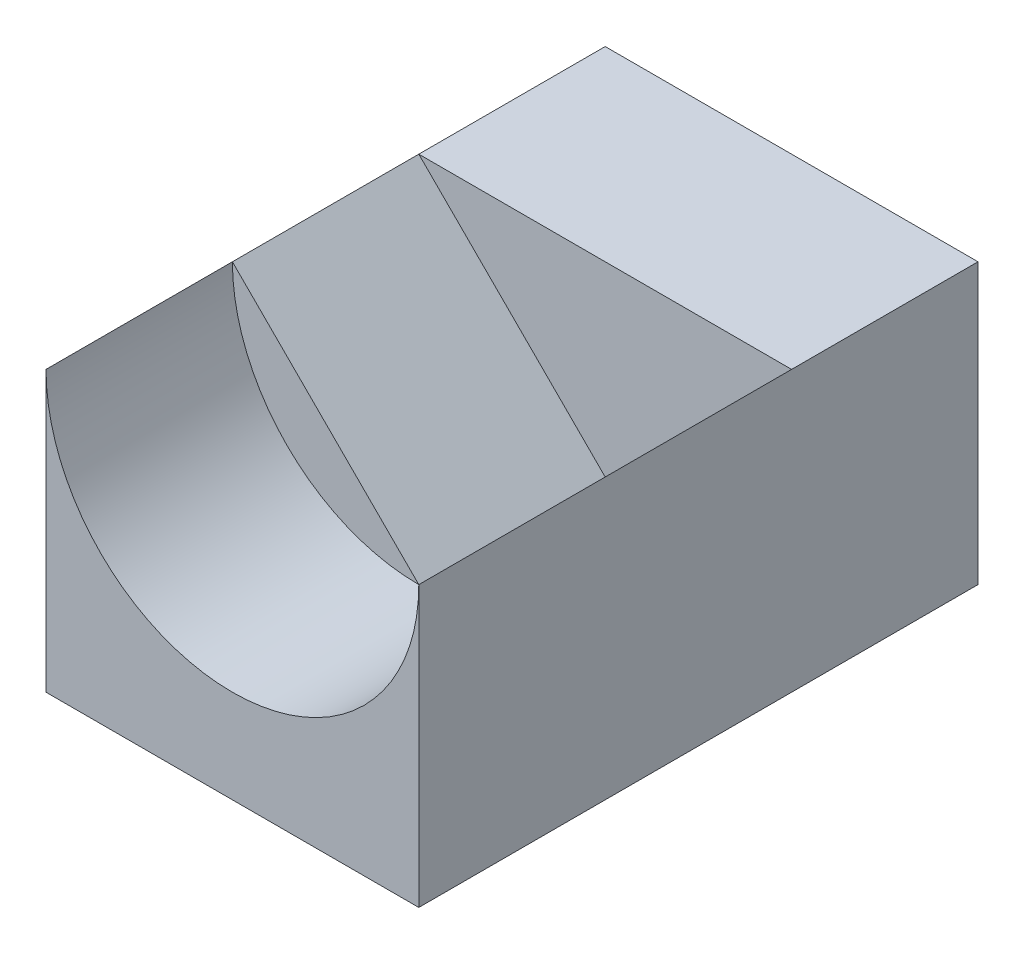
ISO-10303-21;
HEADER;
FILE_DESCRIPTION(('STEP AP214'),'2;1');
FILE_NAME('part.step','',(''),(''),'','','');
FILE_SCHEMA(('AUTOMOTIVE_DESIGN { 1 0 10303 214 1 1 1 1 }'));
ENDSEC;
DATA;
#1=APPLICATION_CONTEXT('core data for automotive mechanical design processes');
#2=APPLICATION_PROTOCOL_DEFINITION('international standard','automotive_design',2000,#1);
#3=PRODUCT_CONTEXT('',#1,'mechanical');
#4=PRODUCT('Part','Part','',(#3));
#5=PRODUCT_RELATED_PRODUCT_CATEGORY('part','',(#4));
#6=PRODUCT_DEFINITION_FORMATION('','',#4);
#7=PRODUCT_DEFINITION_CONTEXT('part definition',#1,'design');
#8=PRODUCT_DEFINITION('design','',#6,#7);
#9=PRODUCT_DEFINITION_SHAPE('','',#8);
#10=(LENGTH_UNIT() NAMED_UNIT(*) SI_UNIT(.MILLI.,.METRE.));
#11=(NAMED_UNIT(*) PLANE_ANGLE_UNIT() SI_UNIT($,.RADIAN.));
#12=(NAMED_UNIT(*) SI_UNIT($,.STERADIAN.) SOLID_ANGLE_UNIT());
#13=UNCERTAINTY_MEASURE_WITH_UNIT(LENGTH_MEASURE(1.E-05),#10,'distance_accuracy_value','');
#14=(GEOMETRIC_REPRESENTATION_CONTEXT(3) GLOBAL_UNCERTAINTY_ASSIGNED_CONTEXT((#13)) GLOBAL_UNIT_ASSIGNED_CONTEXT((#10,
#11,#12)) REPRESENTATION_CONTEXT('',''));
#15=CARTESIAN_POINT('',(0.,0.,0.));
#16=DIRECTION('',(0.,0.,1.));
#17=DIRECTION('',(1.,0.,0.));
#18=AXIS2_PLACEMENT_3D('',#15,#16,#17);
#19=CARTESIAN_POINT('',(0.,7.84514811815443,-1.95457653126341));
#20=DIRECTION('',(0.,-1.,0.));
#21=DIRECTION('',(0.,0.,-1.));
#22=AXIS2_PLACEMENT_3D('',#19,#20,#21);
#23=PLANE('',#22);
#24=DIRECTION('',(-1.,0.,0.));
#25=VECTOR('',#24,1.);
#26=CARTESIAN_POINT('',(2.,7.84514811815443,-2.95457653126341));
#27=LINE('',#26,#25);
#28=CARTESIAN_POINT('',(2.,7.84514811815443,-2.95457653126341));
#29=VERTEX_POINT('',#28);
#30=CARTESIAN_POINT('',(-2.,7.84514811815443,-2.95457653126341));
#31=VERTEX_POINT('',#30);
#32=EDGE_CURVE('E148',#29,#31,#27,.T.);
#33=ORIENTED_EDGE('',*,*,#32,.F.);
#34=DIRECTION('',(0.,0.,-1.));
#35=VECTOR('',#34,1.);
#36=CARTESIAN_POINT('',(2.,7.84514811815443,-4.95457653126341));
#37=LINE('',#36,#35);
#38=CARTESIAN_POINT('',(2.,7.84514811815443,-4.95457653126341));
#39=VERTEX_POINT('',#38);
#40=EDGE_CURVE('E157',#29,#39,#37,.T.);
#41=ORIENTED_EDGE('',*,*,#40,.T.);
#42=DIRECTION('',(-1.,0.,0.));
#43=VECTOR('',#42,1.);
#44=CARTESIAN_POINT('',(2.,7.84514811815443,-4.95457653126341));
#45=LINE('',#44,#43);
#46=CARTESIAN_POINT('',(-2.,7.84514811815443,-4.95457653126341));
#47=VERTEX_POINT('',#46);
#48=EDGE_CURVE('E53',#39,#47,#45,.T.);
#49=ORIENTED_EDGE('',*,*,#48,.T.);
#50=DIRECTION('',(0.,0.,1.));
#51=VECTOR('',#50,1.);
#52=CARTESIAN_POINT('',(-2.,7.84514811815443,-4.95457653126341));
#53=LINE('',#52,#51);
#54=EDGE_CURVE('E83',#47,#31,#53,.T.);
#55=ORIENTED_EDGE('',*,*,#54,.T.);
#56=EDGE_LOOP('',(#33,#41,#49,#55));
#57=FACE_BOUND('',#56,.T.);
#58=ADVANCED_FACE('F36',(#57),#23,.F.);
#59=CARTESIAN_POINT('',(0.,7.84514811815443,-0.954576531263405));
#60=DIRECTION('',(0.,0.,1.));
#61=DIRECTION('',(1.,0.,0.));
#62=AXIS2_PLACEMENT_3D('',#59,#60,#61);
#63=PLANE('',#62);
#64=DIRECTION('',(0.707106781186548,0.707106781186548,0.));
#65=VECTOR('',#64,1.);
#66=CARTESIAN_POINT('',(0.,5.84514811815443,-0.954576531263405));
#67=LINE('',#66,#65);
#68=CARTESIAN_POINT('',(0.,5.84514811815443,-0.954576531263405));
#69=VERTEX_POINT('',#68);
#70=CARTESIAN_POINT('',(2.,7.84514811815443,-0.954576531263405));
#71=VERTEX_POINT('',#70);
#72=EDGE_CURVE('E153',#69,#71,#67,.T.);
#73=ORIENTED_EDGE('',*,*,#72,.F.);
#74=CARTESIAN_POINT('',(0.,7.84514811815443,-0.954576531263405));
#75=DIRECTION('',(0.,0.,1.));
#76=DIRECTION('',(1.,0.,0.));
#77=AXIS2_PLACEMENT_3D('',#74,#75,#76);
#78=CIRCLE('',#77,2.);
#79=EDGE_CURVE('E169',#69,#71,#78,.T.);
#80=ORIENTED_EDGE('',*,*,#79,.T.);
#81=EDGE_LOOP('',(#73,#80));
#82=FACE_BOUND('',#81,.T.);
#83=ADVANCED_FACE('F170',(#82),#63,.T.);
#84=CARTESIAN_POINT('',(-2.,7.84514811815443,-4.95457653126341));
#85=DIRECTION('',(1.,0.,0.));
#86=DIRECTION('',(0.,0.,-1.));
#87=AXIS2_PLACEMENT_3D('',#84,#85,#86);
#88=PLANE('',#87);
#89=DIRECTION('',(0.,0.,1.));
#90=VECTOR('',#89,1.);
#91=CARTESIAN_POINT('',(-2.,4.84514811815443,-4.95457653126341));
#92=LINE('',#91,#90);
#93=CARTESIAN_POINT('',(-2.,4.84514811815443,-4.95457653126341));
#94=VERTEX_POINT('',#93);
#95=CARTESIAN_POINT('',(-2.,4.84514811815443,1.04542346873659));
#96=VERTEX_POINT('',#95);
#97=EDGE_CURVE('E88',#94,#96,#92,.T.);
#98=ORIENTED_EDGE('',*,*,#97,.T.);
#99=DIRECTION('',(0.,-1.,0.));
#100=VECTOR('',#99,1.);
#101=CARTESIAN_POINT('',(-2.,7.84514811815443,1.04542346873659));
#102=LINE('',#101,#100);
#103=CARTESIAN_POINT('',(-2.,7.84514811815443,1.04542346873659));
#104=VERTEX_POINT('',#103);
#105=EDGE_CURVE('E11',#104,#96,#102,.T.);
#106=ORIENTED_EDGE('',*,*,#105,.F.);
#107=DIRECTION('',(0.,0.,1.));
#108=VECTOR('',#107,1.);
#109=CARTESIAN_POINT('',(-2.,7.84514811815443,-0.954576531263405));
#110=LINE('',#109,#108);
#111=CARTESIAN_POINT('',(-2.,7.84514811815443,-0.954576531263405));
#112=VERTEX_POINT('',#111);
#113=EDGE_CURVE('E93',#112,#104,#110,.T.);
#114=ORIENTED_EDGE('',*,*,#113,.F.);
#115=DIRECTION('',(0.,0.,1.));
#116=VECTOR('',#115,1.);
#117=CARTESIAN_POINT('',(-2.,7.84514811815443,-2.95457653126341));
#118=LINE('',#117,#116);
#119=EDGE_CURVE('E141',#31,#112,#118,.T.);
#120=ORIENTED_EDGE('',*,*,#119,.F.);
#121=ORIENTED_EDGE('',*,*,#54,.F.);
#122=DIRECTION('',(0.,-1.,0.));
#123=VECTOR('',#122,1.);
#124=CARTESIAN_POINT('',(-2.,7.84514811815443,-4.95457653126341));
#125=LINE('',#124,#123);
#126=EDGE_CURVE('E78',#47,#94,#125,.T.);
#127=ORIENTED_EDGE('',*,*,#126,.T.);
#128=EDGE_LOOP('',(#98,#106,#114,#120,#121,#127));
#129=FACE_BOUND('',#128,.T.);
#130=ADVANCED_FACE('F38',(#129),#88,.F.);
#131=CARTESIAN_POINT('',(2.,7.84514811815443,1.04542346873659));
#132=DIRECTION('',(0.,0.,-1.));
#133=DIRECTION('',(-1.,0.,0.));
#134=AXIS2_PLACEMENT_3D('',#131,#132,#133);
#135=PLANE('',#134);
#136=DIRECTION('',(0.,-1.,0.));
#137=VECTOR('',#136,1.);
#138=CARTESIAN_POINT('',(2.,7.84514811815443,1.04542346873659));
#139=LINE('',#138,#137);
#140=CARTESIAN_POINT('',(2.,7.84514811815443,1.04542346873659));
#141=VERTEX_POINT('',#140);
#142=CARTESIAN_POINT('',(2.,4.84514811815443,1.04542346873659));
#143=VERTEX_POINT('',#142);
#144=EDGE_CURVE('E45',#141,#143,#139,.T.);
#145=ORIENTED_EDGE('',*,*,#144,.F.);
#146=CARTESIAN_POINT('',(0.,7.84514811815443,1.04542346873659));
#147=DIRECTION('',(0.,0.,1.));
#148=DIRECTION('',(1.,0.,0.));
#149=AXIS2_PLACEMENT_3D('',#146,#147,#148);
#150=CIRCLE('',#149,2.);
#151=EDGE_CURVE('E115',#104,#141,#150,.T.);
#152=ORIENTED_EDGE('',*,*,#151,.F.);
#153=ORIENTED_EDGE('',*,*,#105,.T.);
#154=DIRECTION('',(1.,0.,0.));
#155=VECTOR('',#154,1.);
#156=CARTESIAN_POINT('',(2.,4.84514811815443,1.04542346873659));
#157=LINE('',#156,#155);
#158=EDGE_CURVE('E92',#96,#143,#157,.T.);
#159=ORIENTED_EDGE('',*,*,#158,.T.);
#160=EDGE_LOOP('',(#145,#152,#153,#159));
#161=FACE_BOUND('',#160,.T.);
#162=ADVANCED_FACE('F112',(#161),#135,.F.);
#163=CARTESIAN_POINT('',(2.,7.84514811815443,-4.95457653126341));
#164=DIRECTION('',(-1.,0.,0.));
#165=DIRECTION('',(0.,0.,1.));
#166=AXIS2_PLACEMENT_3D('',#163,#164,#165);
#167=PLANE('',#166);
#168=DIRECTION('',(0.,0.,-1.));
#169=VECTOR('',#168,1.);
#170=CARTESIAN_POINT('',(2.,4.84514811815443,-4.95457653126341));
#171=LINE('',#170,#169);
#172=CARTESIAN_POINT('',(2.,4.84514811815443,-4.95457653126341));
#173=VERTEX_POINT('',#172);
#174=EDGE_CURVE('E70',#143,#173,#171,.T.);
#175=ORIENTED_EDGE('',*,*,#174,.T.);
#176=DIRECTION('',(0.,-1.,0.));
#177=VECTOR('',#176,1.);
#178=CARTESIAN_POINT('',(2.,7.84514811815443,-4.95457653126341));
#179=LINE('',#178,#177);
#180=EDGE_CURVE('E80',#39,#173,#179,.T.);
#181=ORIENTED_EDGE('',*,*,#180,.F.);
#182=ORIENTED_EDGE('',*,*,#40,.F.);
#183=EDGE_CURVE('E159',#71,#29,#37,.T.);
#184=ORIENTED_EDGE('',*,*,#183,.F.);
#185=EDGE_CURVE('E109',#141,#71,#37,.T.);
#186=ORIENTED_EDGE('',*,*,#185,.F.);
#187=ORIENTED_EDGE('',*,*,#144,.T.);
#188=EDGE_LOOP('',(#175,#181,#182,#184,#186,#187));
#189=FACE_BOUND('',#188,.T.);
#190=ADVANCED_FACE('F105',(#189),#167,.F.);
#191=CARTESIAN_POINT('',(2.,7.84514811815443,-4.95457653126341));
#192=DIRECTION('',(0.,0.,1.));
#193=DIRECTION('',(1.,0.,0.));
#194=AXIS2_PLACEMENT_3D('',#191,#192,#193);
#195=PLANE('',#194);
#196=DIRECTION('',(-1.,0.,0.));
#197=VECTOR('',#196,1.);
#198=CARTESIAN_POINT('',(2.,4.84514811815443,-4.95457653126341));
#199=LINE('',#198,#197);
#200=EDGE_CURVE('E75',#173,#94,#199,.T.);
#201=ORIENTED_EDGE('',*,*,#200,.T.);
#202=ORIENTED_EDGE('',*,*,#126,.F.);
#203=ORIENTED_EDGE('',*,*,#48,.F.);
#204=ORIENTED_EDGE('',*,*,#180,.T.);
#205=EDGE_LOOP('',(#201,#202,#203,#204));
#206=FACE_BOUND('',#205,.T.);
#207=ADVANCED_FACE('F77',(#206),#195,.F.);
#208=CARTESIAN_POINT('',(0.,4.84514811815443,-1.95457653126341));
#209=DIRECTION('',(0.,-1.,0.));
#210=DIRECTION('',(0.,0.,-1.));
#211=AXIS2_PLACEMENT_3D('',#208,#209,#210);
#212=PLANE('',#211);
#213=ORIENTED_EDGE('',*,*,#97,.F.);
#214=ORIENTED_EDGE('',*,*,#200,.F.);
#215=ORIENTED_EDGE('',*,*,#174,.F.);
#216=ORIENTED_EDGE('',*,*,#158,.F.);
#217=EDGE_LOOP('',(#213,#214,#215,#216));
#218=FACE_BOUND('',#217,.T.);
#219=ADVANCED_FACE('F91',(#218),#212,.T.);
#220=CARTESIAN_POINT('',(0.,7.84514811815443,-0.954576531263405));
#221=DIRECTION('',(0.,0.,1.));
#222=DIRECTION('',(1.,0.,0.));
#223=AXIS2_PLACEMENT_3D('',#220,#221,#222);
#224=CYLINDRICAL_SURFACE('',#223,2.);
#225=ORIENTED_EDGE('',*,*,#151,.T.);
#226=ORIENTED_EDGE('',*,*,#185,.T.);
#227=ORIENTED_EDGE('',*,*,#79,.F.);
#228=EDGE_CURVE('E97',#112,#69,#78,.T.);
#229=ORIENTED_EDGE('',*,*,#228,.F.);
#230=ORIENTED_EDGE('',*,*,#113,.T.);
#231=EDGE_LOOP('',(#225,#226,#227,#229,#230));
#232=FACE_BOUND('',#231,.T.);
#233=ADVANCED_FACE('F179',(#232),#224,.F.);
#234=DIRECTION('',(0.707106781186547,-0.707106781186548,0.));
#235=VECTOR('',#234,1.);
#236=CARTESIAN_POINT('',(-2.,7.84514811815443,-0.954576531263405));
#237=LINE('',#236,#235);
#238=EDGE_CURVE('E167',#112,#69,#237,.T.);
#239=ORIENTED_EDGE('',*,*,#238,.F.);
#240=ORIENTED_EDGE('',*,*,#228,.T.);
#241=EDGE_LOOP('',(#239,#240));
#242=FACE_BOUND('',#241,.T.);
#243=ADVANCED_FACE('F178',(#242),#63,.T.);
#244=CARTESIAN_POINT('',(0.,5.84514811815443,-2.95457653126341));
#245=DIRECTION('',(0.707106781186548,-0.707106781186548,0.));
#246=DIRECTION('',(0.707106781186548,0.707106781186548,0.));
#247=AXIS2_PLACEMENT_3D('',#244,#245,#246);
#248=PLANE('',#247);
#249=ORIENTED_EDGE('',*,*,#72,.T.);
#250=ORIENTED_EDGE('',*,*,#183,.T.);
#251=DIRECTION('',(0.707106781186548,0.707106781186548,0.));
#252=VECTOR('',#251,1.);
#253=CARTESIAN_POINT('',(0.,5.84514811815443,-2.95457653126341));
#254=LINE('',#253,#252);
#255=CARTESIAN_POINT('',(0.,5.84514811815443,-2.95457653126341));
#256=VERTEX_POINT('',#255);
#257=EDGE_CURVE('E147',#256,#29,#254,.T.);
#258=ORIENTED_EDGE('',*,*,#257,.F.);
#259=DIRECTION('',(0.,0.,1.));
#260=VECTOR('',#259,1.);
#261=CARTESIAN_POINT('',(0.,5.84514811815443,-2.95457653126341));
#262=LINE('',#261,#260);
#263=EDGE_CURVE('E143',#256,#69,#262,.T.);
#264=ORIENTED_EDGE('',*,*,#263,.T.);
#265=EDGE_LOOP('',(#249,#250,#258,#264));
#266=FACE_BOUND('',#265,.T.);
#267=ADVANCED_FACE('F163',(#266),#248,.F.);
#268=CARTESIAN_POINT('',(-2.,7.84514811815443,-2.95457653126341));
#269=DIRECTION('',(-0.707106781186548,-0.707106781186547,0.));
#270=DIRECTION('',(0.707106781186547,-0.707106781186548,0.));
#271=AXIS2_PLACEMENT_3D('',#268,#269,#270);
#272=PLANE('',#271);
#273=ORIENTED_EDGE('',*,*,#238,.T.);
#274=ORIENTED_EDGE('',*,*,#263,.F.);
#275=DIRECTION('',(0.707106781186547,-0.707106781186548,0.));
#276=VECTOR('',#275,1.);
#277=CARTESIAN_POINT('',(-2.,7.84514811815443,-2.95457653126341));
#278=LINE('',#277,#276);
#279=EDGE_CURVE('E137',#31,#256,#278,.T.);
#280=ORIENTED_EDGE('',*,*,#279,.F.);
#281=ORIENTED_EDGE('',*,*,#119,.T.);
#282=EDGE_LOOP('',(#273,#274,#280,#281));
#283=FACE_BOUND('',#282,.T.);
#284=ADVANCED_FACE('F140',(#283),#272,.F.);
#285=CARTESIAN_POINT('',(0.,4.84514811815443,-2.95457653126341));
#286=DIRECTION('',(0.,0.,1.));
#287=DIRECTION('',(1.,0.,0.));
#288=AXIS2_PLACEMENT_3D('',#285,#286,#287);
#289=PLANE('',#288);
#290=ORIENTED_EDGE('',*,*,#32,.T.);
#291=ORIENTED_EDGE('',*,*,#279,.T.);
#292=ORIENTED_EDGE('',*,*,#257,.T.);
#293=EDGE_LOOP('',(#290,#291,#292));
#294=FACE_BOUND('',#293,.T.);
#295=ADVANCED_FACE('F151',(#294),#289,.T.);
#296=CLOSED_SHELL('',(#58,#83,#130,#162,#190,#207,#219,#233,#243,#267,#284,#295));
#297=MANIFOLD_SOLID_BREP('B2',#296);
#298=ADVANCED_BREP_SHAPE_REPRESENTATION('',(#18,#297),#14);
#299=SHAPE_DEFINITION_REPRESENTATION(#9,#298);
ENDSEC;
END-ISO-10303-21;
